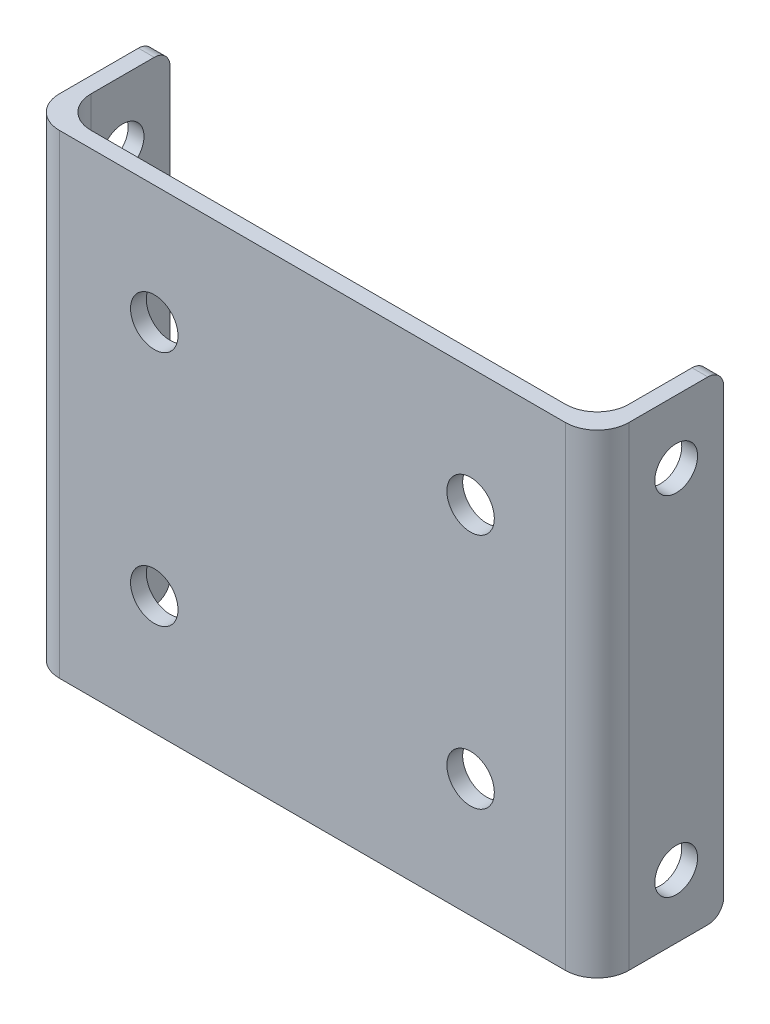
ISO-10303-21;
HEADER;
FILE_DESCRIPTION(('STEP AP214'),'2;1');
FILE_NAME('part.step','',(''),(''),'','','');
FILE_SCHEMA(('AUTOMOTIVE_DESIGN { 1 0 10303 214 1 1 1 1 }'));
ENDSEC;
DATA;
#1=APPLICATION_CONTEXT('core data for automotive mechanical design processes');
#2=APPLICATION_PROTOCOL_DEFINITION('international standard','automotive_design',2000,#1);
#3=PRODUCT_CONTEXT('',#1,'mechanical');
#4=PRODUCT('Part','Part','',(#3));
#5=PRODUCT_RELATED_PRODUCT_CATEGORY('part','',(#4));
#6=PRODUCT_DEFINITION_FORMATION('','',#4);
#7=PRODUCT_DEFINITION_CONTEXT('part definition',#1,'design');
#8=PRODUCT_DEFINITION('design','',#6,#7);
#9=PRODUCT_DEFINITION_SHAPE('','',#8);
#10=(LENGTH_UNIT() NAMED_UNIT(*) SI_UNIT(.MILLI.,.METRE.));
#11=(NAMED_UNIT(*) PLANE_ANGLE_UNIT() SI_UNIT($,.RADIAN.));
#12=(NAMED_UNIT(*) SI_UNIT($,.STERADIAN.) SOLID_ANGLE_UNIT());
#13=UNCERTAINTY_MEASURE_WITH_UNIT(LENGTH_MEASURE(1.E-05),#10,'distance_accuracy_value','');
#14=(GEOMETRIC_REPRESENTATION_CONTEXT(3) GLOBAL_UNCERTAINTY_ASSIGNED_CONTEXT((#13)) GLOBAL_UNIT_ASSIGNED_CONTEXT((#10,
#11,#12)) REPRESENTATION_CONTEXT('',''));
#15=CARTESIAN_POINT('',(0.,0.,0.));
#16=DIRECTION('',(0.,0.,1.));
#17=DIRECTION('',(1.,0.,0.));
#18=AXIS2_PLACEMENT_3D('',#15,#16,#17);
#19=CARTESIAN_POINT('',(13.5000000000001,30.,-0.5));
#20=DIRECTION('',(-1.,0.,0.));
#21=DIRECTION('',(0.,0.,1.));
#22=AXIS2_PLACEMENT_3D('',#19,#20,#21);
#23=PLANE('',#22);
#24=CARTESIAN_POINT('',(13.5000000000001,4.,-4.5));
#25=DIRECTION('',(1.,0.,0.));
#26=DIRECTION('',(0.,0.,-1.));
#27=AXIS2_PLACEMENT_3D('',#24,#25,#26);
#28=CIRCLE('',#27,1.35);
#29=CARTESIAN_POINT('',(13.5000000000001,4.,-5.85));
#30=VERTEX_POINT('',#29);
#31=EDGE_CURVE('E451',#30,#30,#28,.T.);
#32=ORIENTED_EDGE('',*,*,#31,.F.);
#33=EDGE_LOOP('',(#32));
#34=FACE_BOUND('',#33,.T.);
#35=CARTESIAN_POINT('',(13.5000000000001,26.,-4.5));
#36=DIRECTION('',(1.,0.,0.));
#37=DIRECTION('',(0.,0.,-1.));
#38=AXIS2_PLACEMENT_3D('',#35,#36,#37);
#39=CIRCLE('',#38,1.35);
#40=CARTESIAN_POINT('',(13.5000000000001,26.,-5.85));
#41=VERTEX_POINT('',#40);
#42=EDGE_CURVE('E452',#41,#41,#39,.T.);
#43=ORIENTED_EDGE('',*,*,#42,.F.);
#44=EDGE_LOOP('',(#43));
#45=FACE_BOUND('',#44,.T.);
#46=DIRECTION('',(0.,0.,-1.));
#47=VECTOR('',#46,1.);
#48=CARTESIAN_POINT('',(13.5000000000001,0.,-0.5));
#49=LINE('',#48,#47);
#50=CARTESIAN_POINT('',(13.5000000000001,0.,-1.5));
#51=VERTEX_POINT('',#50);
#52=CARTESIAN_POINT('',(13.5000000000001,0.,-6.5));
#53=VERTEX_POINT('',#52);
#54=EDGE_CURVE('E278',#51,#53,#49,.T.);
#55=ORIENTED_EDGE('',*,*,#54,.T.);
#56=CARTESIAN_POINT('',(13.5000000000001,1.,-6.5));
#57=DIRECTION('',(-1.,0.,0.));
#58=DIRECTION('',(0.,0.,1.));
#59=AXIS2_PLACEMENT_3D('',#56,#57,#58);
#60=CIRCLE('',#59,1.);
#61=CARTESIAN_POINT('',(13.5000000000001,1.,-7.5));
#62=VERTEX_POINT('',#61);
#63=EDGE_CURVE('E11',#53,#62,#60,.F.);
#64=ORIENTED_EDGE('',*,*,#63,.T.);
#65=DIRECTION('',(0.,-1.,0.));
#66=VECTOR('',#65,1.);
#67=CARTESIAN_POINT('',(13.5000000000001,30.,-7.5));
#68=LINE('',#67,#66);
#69=CARTESIAN_POINT('',(13.5000000000001,29.,-7.5));
#70=VERTEX_POINT('',#69);
#71=EDGE_CURVE('E194',#70,#62,#68,.T.);
#72=ORIENTED_EDGE('',*,*,#71,.F.);
#73=CARTESIAN_POINT('',(13.5000000000001,29.,-6.5));
#74=DIRECTION('',(-1.,0.,0.));
#75=DIRECTION('',(0.,0.,1.));
#76=AXIS2_PLACEMENT_3D('',#73,#74,#75);
#77=CIRCLE('',#76,1.);
#78=CARTESIAN_POINT('',(13.5000000000001,30.,-6.5));
#79=VERTEX_POINT('',#78);
#80=EDGE_CURVE('E45',#70,#79,#77,.F.);
#81=ORIENTED_EDGE('',*,*,#80,.T.);
#82=DIRECTION('',(0.,0.,-1.));
#83=VECTOR('',#82,1.);
#84=CARTESIAN_POINT('',(13.5000000000001,30.,-0.5));
#85=LINE('',#84,#83);
#86=CARTESIAN_POINT('',(13.5000000000001,30.,-1.5));
#87=VERTEX_POINT('',#86);
#88=EDGE_CURVE('E175',#87,#79,#85,.T.);
#89=ORIENTED_EDGE('',*,*,#88,.F.);
#90=DIRECTION('',(0.,-1.,0.));
#91=VECTOR('',#90,1.);
#92=CARTESIAN_POINT('',(13.5000000000001,30.,-1.5));
#93=LINE('',#92,#91);
#94=EDGE_CURVE('E211',#87,#51,#93,.T.);
#95=ORIENTED_EDGE('',*,*,#94,.T.);
#96=EDGE_LOOP('',(#55,#64,#72,#81,#89,#95));
#97=FACE_BOUND('',#96,.T.);
#98=ADVANCED_FACE('F37',(#34,#45,#97),#23,.F.);
#99=CARTESIAN_POINT('',(13.5000000000001,30.,-7.5));
#100=DIRECTION('',(0.,0.,1.));
#101=DIRECTION('',(1.,0.,0.));
#102=AXIS2_PLACEMENT_3D('',#99,#100,#101);
#103=PLANE('',#102);
#104=ORIENTED_EDGE('',*,*,#71,.T.);
#105=DIRECTION('',(-1.,0.,0.));
#106=VECTOR('',#105,1.);
#107=CARTESIAN_POINT('',(13.5000000000001,1.,-7.5));
#108=LINE('',#107,#106);
#109=CARTESIAN_POINT('',(12.5000000000001,1.,-7.5));
#110=VERTEX_POINT('',#109);
#111=EDGE_CURVE('E250',#62,#110,#108,.T.);
#112=ORIENTED_EDGE('',*,*,#111,.T.);
#113=DIRECTION('',(0.,-1.,0.));
#114=VECTOR('',#113,1.);
#115=CARTESIAN_POINT('',(12.5000000000001,30.,-7.5));
#116=LINE('',#115,#114);
#117=CARTESIAN_POINT('',(12.5000000000001,29.,-7.5));
#118=VERTEX_POINT('',#117);
#119=EDGE_CURVE('E191',#118,#110,#116,.T.);
#120=ORIENTED_EDGE('',*,*,#119,.F.);
#121=DIRECTION('',(-1.,0.,0.));
#122=VECTOR('',#121,1.);
#123=CARTESIAN_POINT('',(13.5000000000001,29.,-7.5));
#124=LINE('',#123,#122);
#125=EDGE_CURVE('E57',#118,#70,#124,.F.);
#126=ORIENTED_EDGE('',*,*,#125,.T.);
#127=EDGE_LOOP('',(#104,#112,#120,#126));
#128=FACE_BOUND('',#127,.T.);
#129=ADVANCED_FACE('F268',(#128),#103,.F.);
#130=CARTESIAN_POINT('',(12.5000000000001,30.,-0.5));
#131=DIRECTION('',(1.,0.,0.));
#132=DIRECTION('',(0.,0.,-1.));
#133=AXIS2_PLACEMENT_3D('',#130,#131,#132);
#134=PLANE('',#133);
#135=CARTESIAN_POINT('',(12.5000000000001,4.,-4.5));
#136=DIRECTION('',(1.,0.,0.));
#137=DIRECTION('',(0.,0.,-1.));
#138=AXIS2_PLACEMENT_3D('',#135,#136,#137);
#139=CIRCLE('',#138,1.35);
#140=CARTESIAN_POINT('',(12.5000000000001,4.,-5.85));
#141=VERTEX_POINT('',#140);
#142=EDGE_CURVE('E375',#141,#141,#139,.T.);
#143=ORIENTED_EDGE('',*,*,#142,.T.);
#144=EDGE_LOOP('',(#143));
#145=FACE_BOUND('',#144,.T.);
#146=CARTESIAN_POINT('',(12.5000000000001,26.,-4.5));
#147=DIRECTION('',(1.,0.,0.));
#148=DIRECTION('',(0.,0.,-1.));
#149=AXIS2_PLACEMENT_3D('',#146,#147,#148);
#150=CIRCLE('',#149,1.35);
#151=CARTESIAN_POINT('',(12.5000000000001,26.,-5.85));
#152=VERTEX_POINT('',#151);
#153=EDGE_CURVE('E378',#152,#152,#150,.T.);
#154=ORIENTED_EDGE('',*,*,#153,.T.);
#155=EDGE_LOOP('',(#154));
#156=FACE_BOUND('',#155,.T.);
#157=ORIENTED_EDGE('',*,*,#119,.T.);
#158=CARTESIAN_POINT('',(12.5000000000001,1.,-6.5));
#159=DIRECTION('',(1.,0.,0.));
#160=DIRECTION('',(0.,0.,-1.));
#161=AXIS2_PLACEMENT_3D('',#158,#159,#160);
#162=CIRCLE('',#161,1.);
#163=CARTESIAN_POINT('',(12.5000000000001,0.,-6.5));
#164=VERTEX_POINT('',#163);
#165=EDGE_CURVE('E255',#110,#164,#162,.F.);
#166=ORIENTED_EDGE('',*,*,#165,.T.);
#167=DIRECTION('',(0.,0.,1.));
#168=VECTOR('',#167,1.);
#169=CARTESIAN_POINT('',(12.5000000000001,0.,-0.5));
#170=LINE('',#169,#168);
#171=CARTESIAN_POINT('',(12.5000000000001,0.,-2.5));
#172=VERTEX_POINT('',#171);
#173=EDGE_CURVE('E274',#164,#172,#170,.T.);
#174=ORIENTED_EDGE('',*,*,#173,.T.);
#175=DIRECTION('',(0.,-1.,0.));
#176=VECTOR('',#175,1.);
#177=CARTESIAN_POINT('',(12.5000000000001,30.,-2.5));
#178=LINE('',#177,#176);
#179=CARTESIAN_POINT('',(12.5000000000001,30.,-2.5));
#180=VERTEX_POINT('',#179);
#181=EDGE_CURVE('E214',#172,#180,#178,.F.);
#182=ORIENTED_EDGE('',*,*,#181,.T.);
#183=DIRECTION('',(0.,0.,1.));
#184=VECTOR('',#183,1.);
#185=CARTESIAN_POINT('',(12.5000000000001,30.,-0.5));
#186=LINE('',#185,#184);
#187=CARTESIAN_POINT('',(12.5000000000001,30.,-6.5));
#188=VERTEX_POINT('',#187);
#189=EDGE_CURVE('E179',#188,#180,#186,.T.);
#190=ORIENTED_EDGE('',*,*,#189,.F.);
#191=CARTESIAN_POINT('',(12.5000000000001,29.,-6.5));
#192=DIRECTION('',(1.,0.,0.));
#193=DIRECTION('',(0.,0.,-1.));
#194=AXIS2_PLACEMENT_3D('',#191,#192,#193);
#195=CIRCLE('',#194,1.);
#196=EDGE_CURVE('E253',#188,#118,#195,.F.);
#197=ORIENTED_EDGE('',*,*,#196,.T.);
#198=EDGE_LOOP('',(#157,#166,#174,#182,#190,#197));
#199=FACE_BOUND('',#198,.T.);
#200=ADVANCED_FACE('F267',(#145,#156,#199),#134,.F.);
#201=CARTESIAN_POINT('',(-21.4999999999999,30.,-0.500000000000001));
#202=DIRECTION('',(0.,0.,1.));
#203=DIRECTION('',(1.,0.,0.));
#204=AXIS2_PLACEMENT_3D('',#201,#202,#203);
#205=PLANE('',#204);
#206=CARTESIAN_POINT('',(-14.4999999999999,7.5,-0.500000000000001));
#207=DIRECTION('',(0.,0.,1.));
#208=DIRECTION('',(1.,0.,0.));
#209=AXIS2_PLACEMENT_3D('',#206,#207,#208);
#210=CIRCLE('',#209,1.5);
#211=CARTESIAN_POINT('',(-12.9999999999999,7.5,-0.500000000000001));
#212=VERTEX_POINT('',#211);
#213=EDGE_CURVE('E384',#212,#212,#210,.T.);
#214=ORIENTED_EDGE('',*,*,#213,.T.);
#215=EDGE_LOOP('',(#214));
#216=FACE_BOUND('',#215,.T.);
#217=CARTESIAN_POINT('',(5.50000000000006,7.5,-0.5));
#218=DIRECTION('',(0.,0.,1.));
#219=DIRECTION('',(1.,0.,0.));
#220=AXIS2_PLACEMENT_3D('',#217,#218,#219);
#221=CIRCLE('',#220,1.5);
#222=CARTESIAN_POINT('',(7.00000000000006,7.5,-0.5));
#223=VERTEX_POINT('',#222);
#224=EDGE_CURVE('E396',#223,#223,#221,.T.);
#225=ORIENTED_EDGE('',*,*,#224,.T.);
#226=EDGE_LOOP('',(#225));
#227=FACE_BOUND('',#226,.T.);
#228=CARTESIAN_POINT('',(5.50000000000006,22.5,-0.5));
#229=DIRECTION('',(0.,0.,1.));
#230=DIRECTION('',(1.,0.,0.));
#231=AXIS2_PLACEMENT_3D('',#228,#229,#230);
#232=CIRCLE('',#231,1.5);
#233=CARTESIAN_POINT('',(7.00000000000005,22.5,-0.5));
#234=VERTEX_POINT('',#233);
#235=EDGE_CURVE('E402',#234,#234,#232,.T.);
#236=ORIENTED_EDGE('',*,*,#235,.T.);
#237=EDGE_LOOP('',(#236));
#238=FACE_BOUND('',#237,.T.);
#239=CARTESIAN_POINT('',(-14.4999999999999,22.5,-0.500000000000001));
#240=DIRECTION('',(0.,0.,1.));
#241=DIRECTION('',(1.,0.,0.));
#242=AXIS2_PLACEMENT_3D('',#239,#240,#241);
#243=CIRCLE('',#242,1.5);
#244=CARTESIAN_POINT('',(-12.9999999999999,22.5,-0.500000000000001));
#245=VERTEX_POINT('',#244);
#246=EDGE_CURVE('E282',#245,#245,#243,.T.);
#247=ORIENTED_EDGE('',*,*,#246,.T.);
#248=EDGE_LOOP('',(#247));
#249=FACE_BOUND('',#248,.T.);
#250=DIRECTION('',(-1.,0.,0.));
#251=VECTOR('',#250,1.);
#252=CARTESIAN_POINT('',(-21.4999999999999,0.,-0.500000000000001));
#253=LINE('',#252,#251);
#254=CARTESIAN_POINT('',(10.5000000000001,0.,-0.5));
#255=VERTEX_POINT('',#254);
#256=CARTESIAN_POINT('',(-19.4999999999999,0.,-0.500000000000001));
#257=VERTEX_POINT('',#256);
#258=EDGE_CURVE('E277',#255,#257,#253,.T.);
#259=ORIENTED_EDGE('',*,*,#258,.T.);
#260=DIRECTION('',(0.,-1.,0.));
#261=VECTOR('',#260,1.);
#262=CARTESIAN_POINT('',(-19.4999999999999,30.,-0.500000000000001));
#263=LINE('',#262,#261);
#264=CARTESIAN_POINT('',(-19.4999999999999,30.,-0.500000000000001));
#265=VERTEX_POINT('',#264);
#266=EDGE_CURVE('E209',#257,#265,#263,.F.);
#267=ORIENTED_EDGE('',*,*,#266,.T.);
#268=DIRECTION('',(-1.,0.,0.));
#269=VECTOR('',#268,1.);
#270=CARTESIAN_POINT('',(-21.4999999999999,30.,-0.500000000000001));
#271=LINE('',#270,#269);
#272=CARTESIAN_POINT('',(10.5000000000001,30.,-0.5));
#273=VERTEX_POINT('',#272);
#274=EDGE_CURVE('E312',#273,#265,#271,.T.);
#275=ORIENTED_EDGE('',*,*,#274,.F.);
#276=DIRECTION('',(0.,-1.,0.));
#277=VECTOR('',#276,1.);
#278=CARTESIAN_POINT('',(10.5000000000001,0.,-0.5));
#279=LINE('',#278,#277);
#280=EDGE_CURVE('E206',#273,#255,#279,.T.);
#281=ORIENTED_EDGE('',*,*,#280,.T.);
#282=EDGE_LOOP('',(#259,#267,#275,#281));
#283=FACE_BOUND('',#282,.T.);
#284=ADVANCED_FACE('F364',(#216,#227,#238,#249,#283),#205,.F.);
#285=CARTESIAN_POINT('',(-21.4999999999999,30.,-0.500000000000001));
#286=DIRECTION('',(-1.,0.,0.));
#287=DIRECTION('',(0.,0.,1.));
#288=AXIS2_PLACEMENT_3D('',#285,#286,#287);
#289=PLANE('',#288);
#290=CARTESIAN_POINT('',(-21.4999999999999,4.,-4.5));
#291=DIRECTION('',(-1.,0.,0.));
#292=DIRECTION('',(0.,0.,1.));
#293=AXIS2_PLACEMENT_3D('',#290,#291,#292);
#294=CIRCLE('',#293,1.35);
#295=CARTESIAN_POINT('',(-21.4999999999999,4.,-3.15));
#296=VERTEX_POINT('',#295);
#297=EDGE_CURVE('E453',#296,#296,#294,.T.);
#298=ORIENTED_EDGE('',*,*,#297,.T.);
#299=EDGE_LOOP('',(#298));
#300=FACE_BOUND('',#299,.T.);
#301=CARTESIAN_POINT('',(-21.4999999999999,26.,-4.5));
#302=DIRECTION('',(-1.,0.,0.));
#303=DIRECTION('',(0.,0.,1.));
#304=AXIS2_PLACEMENT_3D('',#301,#302,#303);
#305=CIRCLE('',#304,1.35);
#306=CARTESIAN_POINT('',(-21.4999999999999,26.,-3.15));
#307=VERTEX_POINT('',#306);
#308=EDGE_CURVE('E381',#307,#307,#305,.T.);
#309=ORIENTED_EDGE('',*,*,#308,.T.);
#310=EDGE_LOOP('',(#309));
#311=FACE_BOUND('',#310,.T.);
#312=DIRECTION('',(0.,-1.,0.));
#313=VECTOR('',#312,1.);
#314=CARTESIAN_POINT('',(-21.4999999999999,30.,-7.5));
#315=LINE('',#314,#313);
#316=CARTESIAN_POINT('',(-21.4999999999999,29.,-7.5));
#317=VERTEX_POINT('',#316);
#318=CARTESIAN_POINT('',(-21.4999999999999,1.,-7.5));
#319=VERTEX_POINT('',#318);
#320=EDGE_CURVE('E188',#317,#319,#315,.T.);
#321=ORIENTED_EDGE('',*,*,#320,.F.);
#322=CARTESIAN_POINT('',(-21.4999999999999,29.,-6.5));
#323=DIRECTION('',(-1.,0.,0.));
#324=DIRECTION('',(0.,0.,1.));
#325=AXIS2_PLACEMENT_3D('',#322,#323,#324);
#326=CIRCLE('',#325,1.);
#327=CARTESIAN_POINT('',(-21.4999999999999,30.,-6.49999999999999));
#328=VERTEX_POINT('',#327);
#329=EDGE_CURVE('E243',#317,#328,#326,.F.);
#330=ORIENTED_EDGE('',*,*,#329,.T.);
#331=DIRECTION('',(0.,0.,-1.));
#332=VECTOR('',#331,1.);
#333=CARTESIAN_POINT('',(-21.4999999999999,30.,-0.500000000000001));
#334=LINE('',#333,#332);
#335=CARTESIAN_POINT('',(-21.4999999999999,30.,-2.5));
#336=VERTEX_POINT('',#335);
#337=EDGE_CURVE('E309',#336,#328,#334,.T.);
#338=ORIENTED_EDGE('',*,*,#337,.F.);
#339=DIRECTION('',(0.,-1.,0.));
#340=VECTOR('',#339,1.);
#341=CARTESIAN_POINT('',(-21.4999999999999,0.,-2.5));
#342=LINE('',#341,#340);
#343=CARTESIAN_POINT('',(-21.4999999999999,0.,-2.5));
#344=VERTEX_POINT('',#343);
#345=EDGE_CURVE('E203',#336,#344,#342,.T.);
#346=ORIENTED_EDGE('',*,*,#345,.T.);
#347=DIRECTION('',(0.,0.,-1.));
#348=VECTOR('',#347,1.);
#349=CARTESIAN_POINT('',(-21.4999999999999,0.,-0.500000000000001));
#350=LINE('',#349,#348);
#351=CARTESIAN_POINT('',(-21.4999999999999,0.,-6.49999999999999));
#352=VERTEX_POINT('',#351);
#353=EDGE_CURVE('E181',#344,#352,#350,.T.);
#354=ORIENTED_EDGE('',*,*,#353,.T.);
#355=CARTESIAN_POINT('',(-21.4999999999999,1.,-6.5));
#356=DIRECTION('',(-1.,0.,0.));
#357=DIRECTION('',(0.,0.,1.));
#358=AXIS2_PLACEMENT_3D('',#355,#356,#357);
#359=CIRCLE('',#358,1.);
#360=EDGE_CURVE('E241',#352,#319,#359,.F.);
#361=ORIENTED_EDGE('',*,*,#360,.T.);
#362=EDGE_LOOP('',(#321,#330,#338,#346,#354,#361));
#363=FACE_BOUND('',#362,.T.);
#364=ADVANCED_FACE('F290',(#300,#311,#363),#289,.F.);
#365=CARTESIAN_POINT('',(-22.4999999999999,30.,-7.5));
#366=DIRECTION('',(0.,0.,1.));
#367=DIRECTION('',(1.,0.,0.));
#368=AXIS2_PLACEMENT_3D('',#365,#366,#367);
#369=PLANE('',#368);
#370=DIRECTION('',(0.,-1.,0.));
#371=VECTOR('',#370,1.);
#372=CARTESIAN_POINT('',(-22.4999999999999,30.,-7.5));
#373=LINE('',#372,#371);
#374=CARTESIAN_POINT('',(-22.4999999999999,29.,-7.5));
#375=VERTEX_POINT('',#374);
#376=CARTESIAN_POINT('',(-22.4999999999999,1.,-7.5));
#377=VERTEX_POINT('',#376);
#378=EDGE_CURVE('E185',#375,#377,#373,.T.);
#379=ORIENTED_EDGE('',*,*,#378,.F.);
#380=DIRECTION('',(-1.,0.,0.));
#381=VECTOR('',#380,1.);
#382=CARTESIAN_POINT('',(-21.4999999999999,29.,-7.5));
#383=LINE('',#382,#381);
#384=EDGE_CURVE('E239',#375,#317,#383,.F.);
#385=ORIENTED_EDGE('',*,*,#384,.T.);
#386=ORIENTED_EDGE('',*,*,#320,.T.);
#387=DIRECTION('',(-1.,0.,0.));
#388=VECTOR('',#387,1.);
#389=CARTESIAN_POINT('',(-22.4999999999999,1.,-7.5));
#390=LINE('',#389,#388);
#391=EDGE_CURVE('E236',#319,#377,#390,.T.);
#392=ORIENTED_EDGE('',*,*,#391,.T.);
#393=EDGE_LOOP('',(#379,#385,#386,#392));
#394=FACE_BOUND('',#393,.T.);
#395=ADVANCED_FACE('F299',(#394),#369,.F.);
#396=CARTESIAN_POINT('',(-22.4999999999999,30.,-0.499999999999996));
#397=DIRECTION('',(1.,0.,0.));
#398=DIRECTION('',(0.,0.,-1.));
#399=AXIS2_PLACEMENT_3D('',#396,#397,#398);
#400=PLANE('',#399);
#401=CARTESIAN_POINT('',(-22.4999999999999,4.,-4.5));
#402=DIRECTION('',(1.,0.,0.));
#403=DIRECTION('',(0.,0.,-1.));
#404=AXIS2_PLACEMENT_3D('',#401,#402,#403);
#405=CIRCLE('',#404,1.35);
#406=CARTESIAN_POINT('',(-22.4999999999999,4.,-5.85));
#407=VERTEX_POINT('',#406);
#408=EDGE_CURVE('E457',#407,#407,#405,.T.);
#409=ORIENTED_EDGE('',*,*,#408,.T.);
#410=EDGE_LOOP('',(#409));
#411=FACE_BOUND('',#410,.T.);
#412=CARTESIAN_POINT('',(-22.4999999999999,26.,-4.5));
#413=DIRECTION('',(1.,0.,0.));
#414=DIRECTION('',(0.,0.,-1.));
#415=AXIS2_PLACEMENT_3D('',#412,#413,#414);
#416=CIRCLE('',#415,1.35);
#417=CARTESIAN_POINT('',(-22.4999999999999,26.,-5.85));
#418=VERTEX_POINT('',#417);
#419=EDGE_CURVE('E387',#418,#418,#416,.T.);
#420=ORIENTED_EDGE('',*,*,#419,.T.);
#421=EDGE_LOOP('',(#420));
#422=FACE_BOUND('',#421,.T.);
#423=DIRECTION('',(0.,0.,1.));
#424=VECTOR('',#423,1.);
#425=CARTESIAN_POINT('',(-22.4999999999999,30.,-0.499999999999996));
#426=LINE('',#425,#424);
#427=CARTESIAN_POINT('',(-22.4999999999999,30.,-6.5));
#428=VERTEX_POINT('',#427);
#429=CARTESIAN_POINT('',(-22.4999999999999,30.,-1.5));
#430=VERTEX_POINT('',#429);
#431=EDGE_CURVE('E304',#428,#430,#426,.T.);
#432=ORIENTED_EDGE('',*,*,#431,.F.);
#433=CARTESIAN_POINT('',(-22.4999999999999,29.,-6.5));
#434=DIRECTION('',(1.,0.,0.));
#435=DIRECTION('',(0.,0.,-1.));
#436=AXIS2_PLACEMENT_3D('',#433,#434,#435);
#437=CIRCLE('',#436,1.);
#438=EDGE_CURVE('E234',#428,#375,#437,.F.);
#439=ORIENTED_EDGE('',*,*,#438,.T.);
#440=ORIENTED_EDGE('',*,*,#378,.T.);
#441=CARTESIAN_POINT('',(-22.4999999999999,1.,-6.5));
#442=DIRECTION('',(1.,0.,0.));
#443=DIRECTION('',(0.,0.,-1.));
#444=AXIS2_PLACEMENT_3D('',#441,#442,#443);
#445=CIRCLE('',#444,1.);
#446=CARTESIAN_POINT('',(-22.4999999999999,0.,-6.5));
#447=VERTEX_POINT('',#446);
#448=EDGE_CURVE('E232',#377,#447,#445,.F.);
#449=ORIENTED_EDGE('',*,*,#448,.T.);
#450=DIRECTION('',(0.,0.,1.));
#451=VECTOR('',#450,1.);
#452=CARTESIAN_POINT('',(-22.4999999999999,0.,-0.499999999999996));
#453=LINE('',#452,#451);
#454=CARTESIAN_POINT('',(-22.4999999999999,0.,-1.5));
#455=VERTEX_POINT('',#454);
#456=EDGE_CURVE('E176',#447,#455,#453,.T.);
#457=ORIENTED_EDGE('',*,*,#456,.T.);
#458=DIRECTION('',(0.,-1.,0.));
#459=VECTOR('',#458,1.);
#460=CARTESIAN_POINT('',(-22.4999999999999,30.,-1.5));
#461=LINE('',#460,#459);
#462=EDGE_CURVE('E157',#455,#430,#461,.F.);
#463=ORIENTED_EDGE('',*,*,#462,.T.);
#464=EDGE_LOOP('',(#432,#439,#440,#449,#457,#463));
#465=FACE_BOUND('',#464,.T.);
#466=ADVANCED_FACE('F303',(#411,#422,#465),#400,.F.);
#467=CARTESIAN_POINT('',(-22.4999999999999,30.,0.499999999999999));
#468=DIRECTION('',(0.,0.,-1.));
#469=DIRECTION('',(-1.,0.,0.));
#470=AXIS2_PLACEMENT_3D('',#467,#468,#469);
#471=PLANE('',#470);
#472=CARTESIAN_POINT('',(-14.4999999999999,7.5,0.499999999999999));
#473=DIRECTION('',(0.,0.,1.));
#474=DIRECTION('',(1.,0.,0.));
#475=AXIS2_PLACEMENT_3D('',#472,#473,#474);
#476=CIRCLE('',#475,1.5);
#477=CARTESIAN_POINT('',(-12.9999999999999,7.5,0.499999999999999));
#478=VERTEX_POINT('',#477);
#479=EDGE_CURVE('E380',#478,#478,#476,.T.);
#480=ORIENTED_EDGE('',*,*,#479,.F.);
#481=EDGE_LOOP('',(#480));
#482=FACE_BOUND('',#481,.T.);
#483=CARTESIAN_POINT('',(5.50000000000006,7.5,0.499999999999999));
#484=DIRECTION('',(0.,0.,1.));
#485=DIRECTION('',(1.,0.,0.));
#486=AXIS2_PLACEMENT_3D('',#483,#484,#485);
#487=CIRCLE('',#486,1.5);
#488=CARTESIAN_POINT('',(7.00000000000006,7.5,0.499999999999999));
#489=VERTEX_POINT('',#488);
#490=EDGE_CURVE('E393',#489,#489,#487,.T.);
#491=ORIENTED_EDGE('',*,*,#490,.F.);
#492=EDGE_LOOP('',(#491));
#493=FACE_BOUND('',#492,.T.);
#494=CARTESIAN_POINT('',(5.50000000000006,22.5,0.499999999999999));
#495=DIRECTION('',(0.,0.,1.));
#496=DIRECTION('',(1.,0.,0.));
#497=AXIS2_PLACEMENT_3D('',#494,#495,#496);
#498=CIRCLE('',#497,1.5);
#499=CARTESIAN_POINT('',(7.00000000000005,22.5,0.499999999999999));
#500=VERTEX_POINT('',#499);
#501=EDGE_CURVE('E399',#500,#500,#498,.T.);
#502=ORIENTED_EDGE('',*,*,#501,.F.);
#503=EDGE_LOOP('',(#502));
#504=FACE_BOUND('',#503,.T.);
#505=CARTESIAN_POINT('',(-14.4999999999999,22.5,0.499999999999999));
#506=DIRECTION('',(0.,0.,1.));
#507=DIRECTION('',(1.,0.,0.));
#508=AXIS2_PLACEMENT_3D('',#505,#506,#507);
#509=CIRCLE('',#508,1.5);
#510=CARTESIAN_POINT('',(-12.9999999999999,22.5,0.499999999999999));
#511=VERTEX_POINT('',#510);
#512=EDGE_CURVE('E405',#511,#511,#509,.T.);
#513=ORIENTED_EDGE('',*,*,#512,.F.);
#514=EDGE_LOOP('',(#513));
#515=FACE_BOUND('',#514,.T.);
#516=DIRECTION('',(1.,0.,0.));
#517=VECTOR('',#516,1.);
#518=CARTESIAN_POINT('',(-22.4999999999999,30.,0.499999999999999));
#519=LINE('',#518,#517);
#520=CARTESIAN_POINT('',(-20.4999999999999,30.,0.499999999999999));
#521=VERTEX_POINT('',#520);
#522=CARTESIAN_POINT('',(11.5000000000001,30.,0.5));
#523=VERTEX_POINT('',#522);
#524=EDGE_CURVE('E170',#521,#523,#519,.T.);
#525=ORIENTED_EDGE('',*,*,#524,.F.);
#526=DIRECTION('',(0.,-1.,0.));
#527=VECTOR('',#526,1.);
#528=CARTESIAN_POINT('',(-20.4999999999999,30.,0.499999999999999));
#529=LINE('',#528,#527);
#530=CARTESIAN_POINT('',(-20.4999999999999,0.,0.499999999999999));
#531=VERTEX_POINT('',#530);
#532=EDGE_CURVE('E155',#521,#531,#529,.T.);
#533=ORIENTED_EDGE('',*,*,#532,.T.);
#534=DIRECTION('',(1.,0.,0.));
#535=VECTOR('',#534,1.);
#536=CARTESIAN_POINT('',(-22.4999999999999,0.,0.499999999999999));
#537=LINE('',#536,#535);
#538=CARTESIAN_POINT('',(11.5000000000001,0.,0.5));
#539=VERTEX_POINT('',#538);
#540=EDGE_CURVE('E167',#531,#539,#537,.T.);
#541=ORIENTED_EDGE('',*,*,#540,.T.);
#542=DIRECTION('',(0.,-1.,0.));
#543=VECTOR('',#542,1.);
#544=CARTESIAN_POINT('',(11.5000000000001,30.,0.5));
#545=LINE('',#544,#543);
#546=EDGE_CURVE('E171',#539,#523,#545,.F.);
#547=ORIENTED_EDGE('',*,*,#546,.T.);
#548=EDGE_LOOP('',(#525,#533,#541,#547));
#549=FACE_BOUND('',#548,.T.);
#550=ADVANCED_FACE('F166',(#482,#493,#504,#515,#549),#471,.F.);
#551=CARTESIAN_POINT('',(0.,30.,0.));
#552=DIRECTION('',(0.,1.,0.));
#553=DIRECTION('',(0.,0.,1.));
#554=AXIS2_PLACEMENT_3D('',#551,#552,#553);
#555=PLANE('',#554);
#556=ORIENTED_EDGE('',*,*,#337,.T.);
#557=DIRECTION('',(-1.,0.,0.));
#558=VECTOR('',#557,1.);
#559=CARTESIAN_POINT('',(-22.4999999999999,30.,-6.5));
#560=LINE('',#559,#558);
#561=EDGE_CURVE('E229',#328,#428,#560,.T.);
#562=ORIENTED_EDGE('',*,*,#561,.T.);
#563=ORIENTED_EDGE('',*,*,#431,.T.);
#564=CARTESIAN_POINT('',(-20.4999999999999,30.,-1.5));
#565=DIRECTION('',(0.,1.,0.));
#566=DIRECTION('',(0.,0.,1.));
#567=AXIS2_PLACEMENT_3D('',#564,#565,#566);
#568=CIRCLE('',#567,2.);
#569=EDGE_CURVE('E201',#430,#521,#568,.T.);
#570=ORIENTED_EDGE('',*,*,#569,.T.);
#571=ORIENTED_EDGE('',*,*,#524,.T.);
#572=CARTESIAN_POINT('',(11.5000000000001,30.,-1.5));
#573=DIRECTION('',(0.,1.,0.));
#574=DIRECTION('',(0.,0.,1.));
#575=AXIS2_PLACEMENT_3D('',#572,#573,#574);
#576=CIRCLE('',#575,2.);
#577=EDGE_CURVE('E199',#523,#87,#576,.T.);
#578=ORIENTED_EDGE('',*,*,#577,.T.);
#579=ORIENTED_EDGE('',*,*,#88,.T.);
#580=DIRECTION('',(-1.,0.,0.));
#581=VECTOR('',#580,1.);
#582=CARTESIAN_POINT('',(12.5000000000001,30.,-6.5));
#583=LINE('',#582,#581);
#584=EDGE_CURVE('E226',#79,#188,#583,.T.);
#585=ORIENTED_EDGE('',*,*,#584,.T.);
#586=ORIENTED_EDGE('',*,*,#189,.T.);
#587=CARTESIAN_POINT('',(10.5000000000001,30.,-2.5));
#588=DIRECTION('',(0.,1.,0.));
#589=DIRECTION('',(0.,0.,1.));
#590=AXIS2_PLACEMENT_3D('',#587,#588,#589);
#591=CIRCLE('',#590,2.);
#592=EDGE_CURVE('E224',#180,#273,#591,.F.);
#593=ORIENTED_EDGE('',*,*,#592,.T.);
#594=ORIENTED_EDGE('',*,*,#274,.T.);
#595=CARTESIAN_POINT('',(-19.4999999999999,30.,-2.5));
#596=DIRECTION('',(0.,1.,0.));
#597=DIRECTION('',(0.,0.,1.));
#598=AXIS2_PLACEMENT_3D('',#595,#596,#597);
#599=CIRCLE('',#598,2.);
#600=EDGE_CURVE('E219',#265,#336,#599,.F.);
#601=ORIENTED_EDGE('',*,*,#600,.T.);
#602=EDGE_LOOP('',(#556,#562,#563,#570,#571,#578,#579,#585,#586,#593,#594,#601));
#603=FACE_BOUND('',#602,.T.);
#604=ADVANCED_FACE('F263',(#603),#555,.T.);
#605=CARTESIAN_POINT('',(0.,0.,0.));
#606=DIRECTION('',(0.,1.,0.));
#607=DIRECTION('',(0.,0.,1.));
#608=AXIS2_PLACEMENT_3D('',#605,#606,#607);
#609=PLANE('',#608);
#610=ORIENTED_EDGE('',*,*,#456,.F.);
#611=DIRECTION('',(-1.,0.,0.));
#612=VECTOR('',#611,1.);
#613=CARTESIAN_POINT('',(0.,0.,-6.5));
#614=LINE('',#613,#612);
#615=EDGE_CURVE('E247',#447,#352,#614,.F.);
#616=ORIENTED_EDGE('',*,*,#615,.T.);
#617=ORIENTED_EDGE('',*,*,#353,.F.);
#618=CARTESIAN_POINT('',(-19.4999999999999,0.,-2.5));
#619=DIRECTION('',(0.,1.,0.));
#620=DIRECTION('',(0.,0.,1.));
#621=AXIS2_PLACEMENT_3D('',#618,#619,#620);
#622=CIRCLE('',#621,2.);
#623=EDGE_CURVE('E217',#344,#257,#622,.T.);
#624=ORIENTED_EDGE('',*,*,#623,.T.);
#625=ORIENTED_EDGE('',*,*,#258,.F.);
#626=CARTESIAN_POINT('',(10.5000000000001,0.,-2.5));
#627=DIRECTION('',(0.,1.,0.));
#628=DIRECTION('',(0.,0.,1.));
#629=AXIS2_PLACEMENT_3D('',#626,#627,#628);
#630=CIRCLE('',#629,2.);
#631=EDGE_CURVE('E221',#255,#172,#630,.T.);
#632=ORIENTED_EDGE('',*,*,#631,.T.);
#633=ORIENTED_EDGE('',*,*,#173,.F.);
#634=DIRECTION('',(-1.,0.,0.));
#635=VECTOR('',#634,1.);
#636=CARTESIAN_POINT('',(0.,0.,-6.49999999999999));
#637=LINE('',#636,#635);
#638=EDGE_CURVE('E245',#164,#53,#637,.F.);
#639=ORIENTED_EDGE('',*,*,#638,.T.);
#640=ORIENTED_EDGE('',*,*,#54,.F.);
#641=CARTESIAN_POINT('',(11.5000000000001,0.,-1.5));
#642=DIRECTION('',(0.,1.,0.));
#643=DIRECTION('',(0.,0.,1.));
#644=AXIS2_PLACEMENT_3D('',#641,#642,#643);
#645=CIRCLE('',#644,2.);
#646=EDGE_CURVE('E161',#51,#539,#645,.F.);
#647=ORIENTED_EDGE('',*,*,#646,.T.);
#648=ORIENTED_EDGE('',*,*,#540,.F.);
#649=CARTESIAN_POINT('',(-20.4999999999999,0.,-1.5));
#650=DIRECTION('',(0.,1.,0.));
#651=DIRECTION('',(0.,0.,1.));
#652=AXIS2_PLACEMENT_3D('',#649,#650,#651);
#653=CIRCLE('',#652,2.);
#654=EDGE_CURVE('E151',#531,#455,#653,.F.);
#655=ORIENTED_EDGE('',*,*,#654,.T.);
#656=EDGE_LOOP('',(#610,#616,#617,#624,#625,#632,#633,#639,#640,#647,#648,#655));
#657=FACE_BOUND('',#656,.T.);
#658=ADVANCED_FACE('F173',(#657),#609,.F.);
#659=CARTESIAN_POINT('',(-20.4999999999999,30.,-1.5));
#660=DIRECTION('',(0.,-1.,0.));
#661=DIRECTION('',(0.,0.,-1.));
#662=AXIS2_PLACEMENT_3D('',#659,#660,#661);
#663=CYLINDRICAL_SURFACE('',#662,2.);
#664=ORIENTED_EDGE('',*,*,#569,.F.);
#665=ORIENTED_EDGE('',*,*,#462,.F.);
#666=ORIENTED_EDGE('',*,*,#654,.F.);
#667=ORIENTED_EDGE('',*,*,#532,.F.);
#668=EDGE_LOOP('',(#664,#665,#666,#667));
#669=FACE_BOUND('',#668,.T.);
#670=ADVANCED_FACE('F154',(#669),#663,.T.);
#671=CARTESIAN_POINT('',(-19.4999999999999,30.,-2.5));
#672=DIRECTION('',(0.,1.,0.));
#673=DIRECTION('',(0.,0.,1.));
#674=AXIS2_PLACEMENT_3D('',#671,#672,#673);
#675=CYLINDRICAL_SURFACE('',#674,2.);
#676=ORIENTED_EDGE('',*,*,#600,.F.);
#677=ORIENTED_EDGE('',*,*,#266,.F.);
#678=ORIENTED_EDGE('',*,*,#623,.F.);
#679=ORIENTED_EDGE('',*,*,#345,.F.);
#680=EDGE_LOOP('',(#676,#677,#678,#679));
#681=FACE_BOUND('',#680,.T.);
#682=ADVANCED_FACE('F321',(#681),#675,.F.);
#683=CARTESIAN_POINT('',(11.5000000000001,30.,-1.5));
#684=DIRECTION('',(0.,-1.,0.));
#685=DIRECTION('',(0.,0.,-1.));
#686=AXIS2_PLACEMENT_3D('',#683,#684,#685);
#687=CYLINDRICAL_SURFACE('',#686,2.);
#688=ORIENTED_EDGE('',*,*,#577,.F.);
#689=ORIENTED_EDGE('',*,*,#546,.F.);
#690=ORIENTED_EDGE('',*,*,#646,.F.);
#691=ORIENTED_EDGE('',*,*,#94,.F.);
#692=EDGE_LOOP('',(#688,#689,#690,#691));
#693=FACE_BOUND('',#692,.T.);
#694=ADVANCED_FACE('F318',(#693),#687,.T.);
#695=CARTESIAN_POINT('',(10.5000000000001,30.,-2.5));
#696=DIRECTION('',(0.,1.,0.));
#697=DIRECTION('',(0.,0.,1.));
#698=AXIS2_PLACEMENT_3D('',#695,#696,#697);
#699=CYLINDRICAL_SURFACE('',#698,2.);
#700=ORIENTED_EDGE('',*,*,#592,.F.);
#701=ORIENTED_EDGE('',*,*,#181,.F.);
#702=ORIENTED_EDGE('',*,*,#631,.F.);
#703=ORIENTED_EDGE('',*,*,#280,.F.);
#704=EDGE_LOOP('',(#700,#701,#702,#703));
#705=FACE_BOUND('',#704,.T.);
#706=ADVANCED_FACE('F320',(#705),#699,.F.);
#707=CARTESIAN_POINT('',(-14.4999999999999,22.5,-7.5));
#708=DIRECTION('',(0.,0.,1.));
#709=DIRECTION('',(1.,0.,0.));
#710=AXIS2_PLACEMENT_3D('',#707,#708,#709);
#711=CYLINDRICAL_SURFACE('',#710,1.5);
#712=ORIENTED_EDGE('',*,*,#512,.T.);
#713=EDGE_LOOP('',(#712));
#714=FACE_BOUND('',#713,.T.);
#715=ORIENTED_EDGE('',*,*,#246,.F.);
#716=EDGE_LOOP('',(#715));
#717=FACE_BOUND('',#716,.T.);
#718=ADVANCED_FACE('F327',(#714,#717),#711,.F.);
#719=CARTESIAN_POINT('',(5.50000000000006,22.5,-7.5));
#720=DIRECTION('',(0.,0.,1.));
#721=DIRECTION('',(1.,0.,0.));
#722=AXIS2_PLACEMENT_3D('',#719,#720,#721);
#723=CYLINDRICAL_SURFACE('',#722,1.5);
#724=ORIENTED_EDGE('',*,*,#501,.T.);
#725=EDGE_LOOP('',(#724));
#726=FACE_BOUND('',#725,.T.);
#727=ORIENTED_EDGE('',*,*,#235,.F.);
#728=EDGE_LOOP('',(#727));
#729=FACE_BOUND('',#728,.T.);
#730=ADVANCED_FACE('F418',(#726,#729),#723,.F.);
#731=CARTESIAN_POINT('',(5.50000000000006,7.5,-7.5));
#732=DIRECTION('',(0.,0.,1.));
#733=DIRECTION('',(1.,0.,0.));
#734=AXIS2_PLACEMENT_3D('',#731,#732,#733);
#735=CYLINDRICAL_SURFACE('',#734,1.5);
#736=ORIENTED_EDGE('',*,*,#490,.T.);
#737=EDGE_LOOP('',(#736));
#738=FACE_BOUND('',#737,.T.);
#739=ORIENTED_EDGE('',*,*,#224,.F.);
#740=EDGE_LOOP('',(#739));
#741=FACE_BOUND('',#740,.T.);
#742=ADVANCED_FACE('F423',(#738,#741),#735,.F.);
#743=CARTESIAN_POINT('',(-14.4999999999999,7.5,-7.5));
#744=DIRECTION('',(0.,0.,1.));
#745=DIRECTION('',(1.,0.,0.));
#746=AXIS2_PLACEMENT_3D('',#743,#744,#745);
#747=CYLINDRICAL_SURFACE('',#746,1.5);
#748=ORIENTED_EDGE('',*,*,#479,.T.);
#749=EDGE_LOOP('',(#748));
#750=FACE_BOUND('',#749,.T.);
#751=ORIENTED_EDGE('',*,*,#213,.F.);
#752=EDGE_LOOP('',(#751));
#753=FACE_BOUND('',#752,.T.);
#754=ADVANCED_FACE('F429',(#750,#753),#747,.F.);
#755=CARTESIAN_POINT('',(-22.4999999999999,26.,-4.5));
#756=DIRECTION('',(1.,0.,0.));
#757=DIRECTION('',(0.,0.,-1.));
#758=AXIS2_PLACEMENT_3D('',#755,#756,#757);
#759=CYLINDRICAL_SURFACE('',#758,1.35);
#760=ORIENTED_EDGE('',*,*,#419,.F.);
#761=EDGE_LOOP('',(#760));
#762=FACE_BOUND('',#761,.T.);
#763=ORIENTED_EDGE('',*,*,#308,.F.);
#764=EDGE_LOOP('',(#763));
#765=FACE_BOUND('',#764,.T.);
#766=ADVANCED_FACE('F433',(#762,#765),#759,.F.);
#767=ORIENTED_EDGE('',*,*,#42,.T.);
#768=EDGE_LOOP('',(#767));
#769=FACE_BOUND('',#768,.T.);
#770=ORIENTED_EDGE('',*,*,#153,.F.);
#771=EDGE_LOOP('',(#770));
#772=FACE_BOUND('',#771,.T.);
#773=ADVANCED_FACE('F435',(#769,#772),#759,.F.);
#774=CARTESIAN_POINT('',(-22.4999999999999,4.,-4.5));
#775=DIRECTION('',(1.,0.,0.));
#776=DIRECTION('',(0.,0.,-1.));
#777=AXIS2_PLACEMENT_3D('',#774,#775,#776);
#778=CYLINDRICAL_SURFACE('',#777,1.35);
#779=ORIENTED_EDGE('',*,*,#408,.F.);
#780=EDGE_LOOP('',(#779));
#781=FACE_BOUND('',#780,.T.);
#782=ORIENTED_EDGE('',*,*,#297,.F.);
#783=EDGE_LOOP('',(#782));
#784=FACE_BOUND('',#783,.T.);
#785=ADVANCED_FACE('F438',(#781,#784),#778,.F.);
#786=ORIENTED_EDGE('',*,*,#31,.T.);
#787=EDGE_LOOP('',(#786));
#788=FACE_BOUND('',#787,.T.);
#789=ORIENTED_EDGE('',*,*,#142,.F.);
#790=EDGE_LOOP('',(#789));
#791=FACE_BOUND('',#790,.T.);
#792=ADVANCED_FACE('F440',(#788,#791),#778,.F.);
#793=CARTESIAN_POINT('',(0.,29.,-6.5));
#794=DIRECTION('',(1.,0.,0.));
#795=DIRECTION('',(0.,0.,-1.));
#796=AXIS2_PLACEMENT_3D('',#793,#794,#795);
#797=CYLINDRICAL_SURFACE('',#796,1.);
#798=ORIENTED_EDGE('',*,*,#329,.F.);
#799=ORIENTED_EDGE('',*,*,#384,.F.);
#800=ORIENTED_EDGE('',*,*,#438,.F.);
#801=ORIENTED_EDGE('',*,*,#561,.F.);
#802=EDGE_LOOP('',(#798,#799,#800,#801));
#803=FACE_BOUND('',#802,.T.);
#804=ADVANCED_FACE('F308',(#803),#797,.T.);
#805=CARTESIAN_POINT('',(-22.4999999999999,1.,-6.5));
#806=DIRECTION('',(-1.,0.,0.));
#807=DIRECTION('',(0.,0.,1.));
#808=AXIS2_PLACEMENT_3D('',#805,#806,#807);
#809=CYLINDRICAL_SURFACE('',#808,1.);
#810=ORIENTED_EDGE('',*,*,#360,.F.);
#811=ORIENTED_EDGE('',*,*,#615,.F.);
#812=ORIENTED_EDGE('',*,*,#448,.F.);
#813=ORIENTED_EDGE('',*,*,#391,.F.);
#814=EDGE_LOOP('',(#810,#811,#812,#813));
#815=FACE_BOUND('',#814,.T.);
#816=ADVANCED_FACE('F296',(#815),#809,.T.);
#817=CARTESIAN_POINT('',(13.5000000000001,1.,-6.5));
#818=DIRECTION('',(-1.,0.,0.));
#819=DIRECTION('',(0.,0.,1.));
#820=AXIS2_PLACEMENT_3D('',#817,#818,#819);
#821=CYLINDRICAL_SURFACE('',#820,1.);
#822=ORIENTED_EDGE('',*,*,#63,.F.);
#823=ORIENTED_EDGE('',*,*,#638,.F.);
#824=ORIENTED_EDGE('',*,*,#165,.F.);
#825=ORIENTED_EDGE('',*,*,#111,.F.);
#826=EDGE_LOOP('',(#822,#823,#824,#825));
#827=FACE_BOUND('',#826,.T.);
#828=ADVANCED_FACE('F271',(#827),#821,.T.);
#829=CARTESIAN_POINT('',(0.,29.,-6.49999999999999));
#830=DIRECTION('',(1.,0.,0.));
#831=DIRECTION('',(0.,0.,-1.));
#832=AXIS2_PLACEMENT_3D('',#829,#830,#831);
#833=CYLINDRICAL_SURFACE('',#832,1.);
#834=ORIENTED_EDGE('',*,*,#80,.F.);
#835=ORIENTED_EDGE('',*,*,#125,.F.);
#836=ORIENTED_EDGE('',*,*,#196,.F.);
#837=ORIENTED_EDGE('',*,*,#584,.F.);
#838=EDGE_LOOP('',(#834,#835,#836,#837));
#839=FACE_BOUND('',#838,.T.);
#840=ADVANCED_FACE('F39',(#839),#833,.T.);
#841=CLOSED_SHELL('',(#98,#129,#200,#284,#364,#395,#466,#550,#604,#658,#670,#682,#694,#706,#718,
#730,#742,#754,#766,#773,#785,#792,#804,#816,#828,#840));
#842=MANIFOLD_SOLID_BREP('B2',#841);
#843=ADVANCED_BREP_SHAPE_REPRESENTATION('',(#18,#842),#14);
#844=SHAPE_DEFINITION_REPRESENTATION(#9,#843);
ENDSEC;
END-ISO-10303-21;
